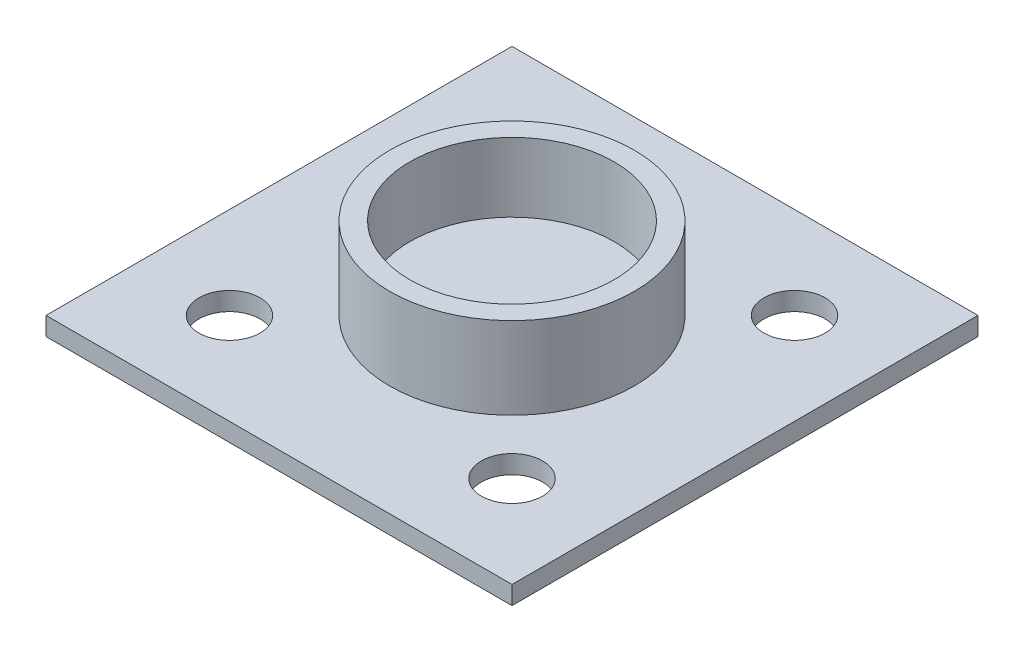
ISO-10303-21;
HEADER;
FILE_DESCRIPTION(('STEP AP214'),'2;1');
FILE_NAME('part.step','',(''),(''),'','','');
FILE_SCHEMA(('AUTOMOTIVE_DESIGN { 1 0 10303 214 1 1 1 1 }'));
ENDSEC;
DATA;
#1=APPLICATION_CONTEXT('core data for automotive mechanical design processes');
#2=APPLICATION_PROTOCOL_DEFINITION('international standard','automotive_design',2000,#1);
#3=PRODUCT_CONTEXT('',#1,'mechanical');
#4=PRODUCT('Part','Part','',(#3));
#5=PRODUCT_RELATED_PRODUCT_CATEGORY('part','',(#4));
#6=PRODUCT_DEFINITION_FORMATION('','',#4);
#7=PRODUCT_DEFINITION_CONTEXT('part definition',#1,'design');
#8=PRODUCT_DEFINITION('design','',#6,#7);
#9=PRODUCT_DEFINITION_SHAPE('','',#8);
#10=(LENGTH_UNIT() NAMED_UNIT(*) SI_UNIT(.MILLI.,.METRE.));
#11=(NAMED_UNIT(*) PLANE_ANGLE_UNIT() SI_UNIT($,.RADIAN.));
#12=(NAMED_UNIT(*) SI_UNIT($,.STERADIAN.) SOLID_ANGLE_UNIT());
#13=UNCERTAINTY_MEASURE_WITH_UNIT(LENGTH_MEASURE(1.E-05),#10,'distance_accuracy_value','');
#14=(GEOMETRIC_REPRESENTATION_CONTEXT(3) GLOBAL_UNCERTAINTY_ASSIGNED_CONTEXT((#13)) GLOBAL_UNIT_ASSIGNED_CONTEXT((#10,
#11,#12)) REPRESENTATION_CONTEXT('',''));
#15=CARTESIAN_POINT('',(0.,0.,0.));
#16=DIRECTION('',(0.,0.,1.));
#17=DIRECTION('',(1.,0.,0.));
#18=AXIS2_PLACEMENT_3D('',#15,#16,#17);
#19=CARTESIAN_POINT('',(0.,-8.2,0.));
#20=DIRECTION('',(0.,1.,0.));
#21=DIRECTION('',(0.,0.,1.));
#22=AXIS2_PLACEMENT_3D('',#19,#20,#21);
#23=CYLINDRICAL_SURFACE('',#22,10.);
#24=CARTESIAN_POINT('',(0.,0.,0.));
#25=DIRECTION('',(0.,1.,0.));
#26=DIRECTION('',(0.,0.,1.));
#27=AXIS2_PLACEMENT_3D('',#24,#25,#26);
#28=CIRCLE('',#27,10.);
#29=CARTESIAN_POINT('',(0.,0.,10.));
#30=VERTEX_POINT('',#29);
#31=EDGE_CURVE('E11',#30,#30,#28,.T.);
#32=ORIENTED_EDGE('',*,*,#31,.F.);
#33=EDGE_LOOP('',(#32));
#34=FACE_BOUND('',#33,.T.);
#35=CARTESIAN_POINT('',(0.,-6.7,0.));
#36=DIRECTION('',(0.,-1.,0.));
#37=DIRECTION('',(0.,0.,-1.));
#38=AXIS2_PLACEMENT_3D('',#35,#36,#37);
#39=CIRCLE('',#38,10.);
#40=CARTESIAN_POINT('',(0.,-6.7,-10.));
#41=VERTEX_POINT('',#40);
#42=EDGE_CURVE('E111',#41,#41,#39,.F.);
#43=ORIENTED_EDGE('',*,*,#42,.T.);
#44=EDGE_LOOP('',(#43));
#45=FACE_BOUND('',#44,.T.);
#46=ADVANCED_FACE('F32',(#34,#45),#23,.T.);
#47=CARTESIAN_POINT('',(0.,0.,0.));
#48=DIRECTION('',(0.,1.,0.));
#49=DIRECTION('',(0.,0.,1.));
#50=AXIS2_PLACEMENT_3D('',#47,#48,#49);
#51=PLANE('',#50);
#52=CARTESIAN_POINT('',(0.,0.,0.));
#53=DIRECTION('',(0.,1.,0.));
#54=DIRECTION('',(0.,0.,1.));
#55=AXIS2_PLACEMENT_3D('',#52,#53,#54);
#56=CIRCLE('',#55,8.354);
#57=CARTESIAN_POINT('',(0.,0.,8.354));
#58=VERTEX_POINT('',#57);
#59=EDGE_CURVE('E116',#58,#58,#56,.T.);
#60=ORIENTED_EDGE('',*,*,#59,.F.);
#61=EDGE_LOOP('',(#60));
#62=FACE_BOUND('',#61,.T.);
#63=ORIENTED_EDGE('',*,*,#31,.T.);
#64=EDGE_LOOP('',(#63));
#65=FACE_BOUND('',#64,.T.);
#66=ADVANCED_FACE('F150',(#62,#65),#51,.T.);
#67=CARTESIAN_POINT('',(0.,-5.65,0.));
#68=DIRECTION('',(0.,1.,0.));
#69=DIRECTION('',(0.,0.,1.));
#70=AXIS2_PLACEMENT_3D('',#67,#68,#69);
#71=CYLINDRICAL_SURFACE('',#70,8.354);
#72=CARTESIAN_POINT('',(0.,-5.65,0.));
#73=DIRECTION('',(0.,1.,0.));
#74=DIRECTION('',(0.,0.,1.));
#75=AXIS2_PLACEMENT_3D('',#72,#73,#74);
#76=CIRCLE('',#75,8.354);
#77=CARTESIAN_POINT('',(0.,-5.65,8.354));
#78=VERTEX_POINT('',#77);
#79=EDGE_CURVE('E41',#78,#78,#76,.T.);
#80=ORIENTED_EDGE('',*,*,#79,.F.);
#81=EDGE_LOOP('',(#80));
#82=FACE_BOUND('',#81,.T.);
#83=ORIENTED_EDGE('',*,*,#59,.T.);
#84=EDGE_LOOP('',(#83));
#85=FACE_BOUND('',#84,.T.);
#86=ADVANCED_FACE('F155',(#82,#85),#71,.F.);
#87=CARTESIAN_POINT('',(0.,-5.65,0.));
#88=DIRECTION('',(0.,1.,0.));
#89=DIRECTION('',(0.,0.,1.));
#90=AXIS2_PLACEMENT_3D('',#87,#88,#89);
#91=PLANE('',#90);
#92=ORIENTED_EDGE('',*,*,#79,.T.);
#93=EDGE_LOOP('',(#92));
#94=FACE_BOUND('',#93,.T.);
#95=ADVANCED_FACE('F182',(#94),#91,.T.);
#96=CARTESIAN_POINT('',(19.05,-6.7,19.05));
#97=DIRECTION('',(1.,0.,0.));
#98=DIRECTION('',(0.,0.,-1.));
#99=AXIS2_PLACEMENT_3D('',#96,#97,#98);
#100=PLANE('',#99);
#101=DIRECTION('',(0.,0.,1.));
#102=VECTOR('',#101,1.);
#103=CARTESIAN_POINT('',(19.05,-8.2,19.05));
#104=LINE('',#103,#102);
#105=CARTESIAN_POINT('',(19.05,-8.2,-19.05));
#106=VERTEX_POINT('',#105);
#107=CARTESIAN_POINT('',(19.05,-8.2,19.05));
#108=VERTEX_POINT('',#107);
#109=EDGE_CURVE('E102',#106,#108,#104,.T.);
#110=ORIENTED_EDGE('',*,*,#109,.F.);
#111=DIRECTION('',(0.,-1.,0.));
#112=VECTOR('',#111,1.);
#113=CARTESIAN_POINT('',(19.05,-6.7,-19.05));
#114=LINE('',#113,#112);
#115=CARTESIAN_POINT('',(19.05,-6.7,-19.05));
#116=VERTEX_POINT('',#115);
#117=EDGE_CURVE('E50',#116,#106,#114,.T.);
#118=ORIENTED_EDGE('',*,*,#117,.F.);
#119=DIRECTION('',(0.,0.,1.));
#120=VECTOR('',#119,1.);
#121=CARTESIAN_POINT('',(19.05,-6.7,19.05));
#122=LINE('',#121,#120);
#123=CARTESIAN_POINT('',(19.05,-6.7,19.05));
#124=VERTEX_POINT('',#123);
#125=EDGE_CURVE('E95',#116,#124,#122,.T.);
#126=ORIENTED_EDGE('',*,*,#125,.T.);
#127=DIRECTION('',(0.,-1.,0.));
#128=VECTOR('',#127,1.);
#129=CARTESIAN_POINT('',(19.05,-6.7,19.05));
#130=LINE('',#129,#128);
#131=EDGE_CURVE('E78',#124,#108,#130,.T.);
#132=ORIENTED_EDGE('',*,*,#131,.T.);
#133=EDGE_LOOP('',(#110,#118,#126,#132));
#134=FACE_BOUND('',#133,.T.);
#135=ADVANCED_FACE('F177',(#134),#100,.T.);
#136=CARTESIAN_POINT('',(-19.05,-6.7,-19.05));
#137=DIRECTION('',(0.,0.,-1.));
#138=DIRECTION('',(-1.,0.,0.));
#139=AXIS2_PLACEMENT_3D('',#136,#137,#138);
#140=PLANE('',#139);
#141=DIRECTION('',(1.,0.,0.));
#142=VECTOR('',#141,1.);
#143=CARTESIAN_POINT('',(-19.05,-8.2,-19.05));
#144=LINE('',#143,#142);
#145=CARTESIAN_POINT('',(-19.05,-8.2,-19.05));
#146=VERTEX_POINT('',#145);
#147=EDGE_CURVE('E97',#146,#106,#144,.T.);
#148=ORIENTED_EDGE('',*,*,#147,.F.);
#149=DIRECTION('',(0.,-1.,0.));
#150=VECTOR('',#149,1.);
#151=CARTESIAN_POINT('',(-19.05,-6.7,-19.05));
#152=LINE('',#151,#150);
#153=CARTESIAN_POINT('',(-19.05,-6.7,-19.05));
#154=VERTEX_POINT('',#153);
#155=EDGE_CURVE('E67',#154,#146,#152,.T.);
#156=ORIENTED_EDGE('',*,*,#155,.F.);
#157=DIRECTION('',(1.,0.,0.));
#158=VECTOR('',#157,1.);
#159=CARTESIAN_POINT('',(-19.05,-6.7,-19.05));
#160=LINE('',#159,#158);
#161=EDGE_CURVE('E92',#154,#116,#160,.T.);
#162=ORIENTED_EDGE('',*,*,#161,.T.);
#163=ORIENTED_EDGE('',*,*,#117,.T.);
#164=EDGE_LOOP('',(#148,#156,#162,#163));
#165=FACE_BOUND('',#164,.T.);
#166=ADVANCED_FACE('F174',(#165),#140,.T.);
#167=CARTESIAN_POINT('',(-19.05,-6.7,19.05));
#168=DIRECTION('',(-1.,0.,0.));
#169=DIRECTION('',(0.,0.,1.));
#170=AXIS2_PLACEMENT_3D('',#167,#168,#169);
#171=PLANE('',#170);
#172=DIRECTION('',(0.,0.,-1.));
#173=VECTOR('',#172,1.);
#174=CARTESIAN_POINT('',(-19.05,-8.2,19.05));
#175=LINE('',#174,#173);
#176=CARTESIAN_POINT('',(-19.05,-8.2,19.05));
#177=VERTEX_POINT('',#176);
#178=EDGE_CURVE('E86',#177,#146,#175,.T.);
#179=ORIENTED_EDGE('',*,*,#178,.F.);
#180=DIRECTION('',(0.,-1.,0.));
#181=VECTOR('',#180,1.);
#182=CARTESIAN_POINT('',(-19.05,-6.7,19.05));
#183=LINE('',#182,#181);
#184=CARTESIAN_POINT('',(-19.05,-6.7,19.05));
#185=VERTEX_POINT('',#184);
#186=EDGE_CURVE('E81',#185,#177,#183,.T.);
#187=ORIENTED_EDGE('',*,*,#186,.F.);
#188=DIRECTION('',(0.,0.,-1.));
#189=VECTOR('',#188,1.);
#190=CARTESIAN_POINT('',(-19.05,-6.7,19.05));
#191=LINE('',#190,#189);
#192=EDGE_CURVE('E84',#185,#154,#191,.T.);
#193=ORIENTED_EDGE('',*,*,#192,.T.);
#194=ORIENTED_EDGE('',*,*,#155,.T.);
#195=EDGE_LOOP('',(#179,#187,#193,#194));
#196=FACE_BOUND('',#195,.T.);
#197=ADVANCED_FACE('F83',(#196),#171,.T.);
#198=CARTESIAN_POINT('',(-19.05,-6.7,19.05));
#199=DIRECTION('',(0.,0.,1.));
#200=DIRECTION('',(1.,0.,0.));
#201=AXIS2_PLACEMENT_3D('',#198,#199,#200);
#202=PLANE('',#201);
#203=DIRECTION('',(-1.,0.,0.));
#204=VECTOR('',#203,1.);
#205=CARTESIAN_POINT('',(-19.05,-8.2,19.05));
#206=LINE('',#205,#204);
#207=EDGE_CURVE('E105',#108,#177,#206,.T.);
#208=ORIENTED_EDGE('',*,*,#207,.F.);
#209=ORIENTED_EDGE('',*,*,#131,.F.);
#210=DIRECTION('',(-1.,0.,0.));
#211=VECTOR('',#210,1.);
#212=CARTESIAN_POINT('',(-19.05,-6.7,19.05));
#213=LINE('',#212,#211);
#214=EDGE_CURVE('E91',#124,#185,#213,.T.);
#215=ORIENTED_EDGE('',*,*,#214,.T.);
#216=ORIENTED_EDGE('',*,*,#186,.T.);
#217=EDGE_LOOP('',(#208,#209,#215,#216));
#218=FACE_BOUND('',#217,.T.);
#219=ADVANCED_FACE('F94',(#218),#202,.T.);
#220=CARTESIAN_POINT('',(0.,-6.7,0.));
#221=DIRECTION('',(0.,-1.,0.));
#222=DIRECTION('',(0.,0.,-1.));
#223=AXIS2_PLACEMENT_3D('',#220,#221,#222);
#224=PLANE('',#223);
#225=CARTESIAN_POINT('',(-11.5499999999993,-6.7,11.55));
#226=DIRECTION('',(0.,1.,0.));
#227=DIRECTION('',(0.,0.,1.));
#228=AXIS2_PLACEMENT_3D('',#225,#226,#227);
#229=CIRCLE('',#228,2.50000000000035);
#230=CARTESIAN_POINT('',(-11.5499999999993,-6.7,14.0500000000004));
#231=VERTEX_POINT('',#230);
#232=EDGE_CURVE('E273',#231,#231,#229,.T.);
#233=ORIENTED_EDGE('',*,*,#232,.F.);
#234=EDGE_LOOP('',(#233));
#235=FACE_BOUND('',#234,.T.);
#236=CARTESIAN_POINT('',(11.5500000000007,-6.7,11.5499999999994));
#237=DIRECTION('',(0.,1.,0.));
#238=DIRECTION('',(0.,0.,1.));
#239=AXIS2_PLACEMENT_3D('',#236,#237,#238);
#240=CIRCLE('',#239,2.50000000000092);
#241=CARTESIAN_POINT('',(11.5500000000007,-6.7,14.0500000000003));
#242=VERTEX_POINT('',#241);
#243=EDGE_CURVE('E269',#242,#242,#240,.T.);
#244=ORIENTED_EDGE('',*,*,#243,.F.);
#245=EDGE_LOOP('',(#244));
#246=FACE_BOUND('',#245,.T.);
#247=CARTESIAN_POINT('',(11.55,-6.7,-11.5500000000007));
#248=DIRECTION('',(0.,1.,0.));
#249=DIRECTION('',(0.,0.,1.));
#250=AXIS2_PLACEMENT_3D('',#247,#248,#249);
#251=CIRCLE('',#250,2.50000000000068);
#252=CARTESIAN_POINT('',(11.55,-6.7,-9.04999999999998));
#253=VERTEX_POINT('',#252);
#254=EDGE_CURVE('E261',#253,#253,#251,.T.);
#255=ORIENTED_EDGE('',*,*,#254,.F.);
#256=EDGE_LOOP('',(#255));
#257=FACE_BOUND('',#256,.T.);
#258=CARTESIAN_POINT('',(-11.55,-6.7,-11.55));
#259=DIRECTION('',(0.,1.,0.));
#260=DIRECTION('',(0.,0.,1.));
#261=AXIS2_PLACEMENT_3D('',#258,#259,#260);
#262=CIRCLE('',#261,2.5);
#263=CARTESIAN_POINT('',(-11.55,-6.7,-9.05));
#264=VERTEX_POINT('',#263);
#265=EDGE_CURVE('E125',#264,#264,#262,.T.);
#266=ORIENTED_EDGE('',*,*,#265,.F.);
#267=EDGE_LOOP('',(#266));
#268=FACE_BOUND('',#267,.T.);
#269=ORIENTED_EDGE('',*,*,#42,.F.);
#270=EDGE_LOOP('',(#269));
#271=FACE_BOUND('',#270,.T.);
#272=ORIENTED_EDGE('',*,*,#125,.F.);
#273=ORIENTED_EDGE('',*,*,#161,.F.);
#274=ORIENTED_EDGE('',*,*,#192,.F.);
#275=ORIENTED_EDGE('',*,*,#214,.F.);
#276=EDGE_LOOP('',(#272,#273,#274,#275));
#277=FACE_BOUND('',#276,.T.);
#278=ADVANCED_FACE('F90',(#235,#246,#257,#268,#271,#277),#224,.F.);
#279=CARTESIAN_POINT('',(0.,-8.2,0.));
#280=DIRECTION('',(0.,1.,0.));
#281=DIRECTION('',(0.,0.,1.));
#282=AXIS2_PLACEMENT_3D('',#279,#280,#281);
#283=PLANE('',#282);
#284=CARTESIAN_POINT('',(-11.5499999999993,-8.2,11.55));
#285=DIRECTION('',(0.,1.,0.));
#286=DIRECTION('',(0.,0.,1.));
#287=AXIS2_PLACEMENT_3D('',#284,#285,#286);
#288=CIRCLE('',#287,2.50000000000035);
#289=CARTESIAN_POINT('',(-11.5499999999993,-8.2,14.0500000000004));
#290=VERTEX_POINT('',#289);
#291=EDGE_CURVE('E35',#290,#290,#288,.T.);
#292=ORIENTED_EDGE('',*,*,#291,.T.);
#293=EDGE_LOOP('',(#292));
#294=FACE_BOUND('',#293,.T.);
#295=CARTESIAN_POINT('',(11.5500000000007,-8.2,11.5499999999994));
#296=DIRECTION('',(0.,1.,0.));
#297=DIRECTION('',(0.,0.,1.));
#298=AXIS2_PLACEMENT_3D('',#295,#296,#297);
#299=CIRCLE('',#298,2.50000000000092);
#300=CARTESIAN_POINT('',(11.5500000000007,-8.2,14.0500000000003));
#301=VERTEX_POINT('',#300);
#302=EDGE_CURVE('E127',#301,#301,#299,.T.);
#303=ORIENTED_EDGE('',*,*,#302,.T.);
#304=EDGE_LOOP('',(#303));
#305=FACE_BOUND('',#304,.T.);
#306=CARTESIAN_POINT('',(11.55,-8.2,-11.5500000000007));
#307=DIRECTION('',(0.,1.,0.));
#308=DIRECTION('',(0.,0.,1.));
#309=AXIS2_PLACEMENT_3D('',#306,#307,#308);
#310=CIRCLE('',#309,2.50000000000068);
#311=CARTESIAN_POINT('',(11.55,-8.2,-9.04999999999998));
#312=VERTEX_POINT('',#311);
#313=EDGE_CURVE('E124',#312,#312,#310,.T.);
#314=ORIENTED_EDGE('',*,*,#313,.T.);
#315=EDGE_LOOP('',(#314));
#316=FACE_BOUND('',#315,.T.);
#317=CARTESIAN_POINT('',(-11.55,-8.2,-11.55));
#318=DIRECTION('',(0.,1.,0.));
#319=DIRECTION('',(0.,0.,1.));
#320=AXIS2_PLACEMENT_3D('',#317,#318,#319);
#321=CIRCLE('',#320,2.5);
#322=CARTESIAN_POINT('',(-11.55,-8.2,-9.05));
#323=VERTEX_POINT('',#322);
#324=EDGE_CURVE('E121',#323,#323,#321,.T.);
#325=ORIENTED_EDGE('',*,*,#324,.T.);
#326=EDGE_LOOP('',(#325));
#327=FACE_BOUND('',#326,.T.);
#328=ORIENTED_EDGE('',*,*,#109,.T.);
#329=ORIENTED_EDGE('',*,*,#207,.T.);
#330=ORIENTED_EDGE('',*,*,#178,.T.);
#331=ORIENTED_EDGE('',*,*,#147,.T.);
#332=EDGE_LOOP('',(#328,#329,#330,#331));
#333=FACE_BOUND('',#332,.T.);
#334=ADVANCED_FACE('F134',(#294,#305,#316,#327,#333),#283,.F.);
#335=CARTESIAN_POINT('',(-11.55,-8.7,-11.55));
#336=DIRECTION('',(0.,1.,0.));
#337=DIRECTION('',(0.,0.,1.));
#338=AXIS2_PLACEMENT_3D('',#335,#336,#337);
#339=CYLINDRICAL_SURFACE('',#338,2.5);
#340=ORIENTED_EDGE('',*,*,#265,.T.);
#341=EDGE_LOOP('',(#340));
#342=FACE_BOUND('',#341,.T.);
#343=ORIENTED_EDGE('',*,*,#324,.F.);
#344=EDGE_LOOP('',(#343));
#345=FACE_BOUND('',#344,.T.);
#346=ADVANCED_FACE('F168',(#342,#345),#339,.F.);
#347=CARTESIAN_POINT('',(11.55,-8.7,-11.5500000000007));
#348=DIRECTION('',(0.,1.,0.));
#349=DIRECTION('',(0.,0.,1.));
#350=AXIS2_PLACEMENT_3D('',#347,#348,#349);
#351=CYLINDRICAL_SURFACE('',#350,2.50000000000068);
#352=ORIENTED_EDGE('',*,*,#254,.T.);
#353=EDGE_LOOP('',(#352));
#354=FACE_BOUND('',#353,.T.);
#355=ORIENTED_EDGE('',*,*,#313,.F.);
#356=EDGE_LOOP('',(#355));
#357=FACE_BOUND('',#356,.T.);
#358=ADVANCED_FACE('F144',(#354,#357),#351,.F.);
#359=CARTESIAN_POINT('',(11.5500000000007,-8.7,11.5499999999994));
#360=DIRECTION('',(0.,1.,0.));
#361=DIRECTION('',(0.,0.,1.));
#362=AXIS2_PLACEMENT_3D('',#359,#360,#361);
#363=CYLINDRICAL_SURFACE('',#362,2.50000000000092);
#364=ORIENTED_EDGE('',*,*,#243,.T.);
#365=EDGE_LOOP('',(#364));
#366=FACE_BOUND('',#365,.T.);
#367=ORIENTED_EDGE('',*,*,#302,.F.);
#368=EDGE_LOOP('',(#367));
#369=FACE_BOUND('',#368,.T.);
#370=ADVANCED_FACE('F138',(#366,#369),#363,.F.);
#371=CARTESIAN_POINT('',(-11.5499999999993,-8.7,11.55));
#372=DIRECTION('',(0.,1.,0.));
#373=DIRECTION('',(0.,0.,1.));
#374=AXIS2_PLACEMENT_3D('',#371,#372,#373);
#375=CYLINDRICAL_SURFACE('',#374,2.50000000000035);
#376=ORIENTED_EDGE('',*,*,#232,.T.);
#377=EDGE_LOOP('',(#376));
#378=FACE_BOUND('',#377,.T.);
#379=ORIENTED_EDGE('',*,*,#291,.F.);
#380=EDGE_LOOP('',(#379));
#381=FACE_BOUND('',#380,.T.);
#382=ADVANCED_FACE('F136',(#378,#381),#375,.F.);
#383=CLOSED_SHELL('',(#46,#66,#86,#95,#135,#166,#197,#219,#278,#334,#346,#358,#370,#382));
#384=MANIFOLD_SOLID_BREP('B2',#383);
#385=ADVANCED_BREP_SHAPE_REPRESENTATION('',(#18,#384),#14);
#386=SHAPE_DEFINITION_REPRESENTATION(#9,#385);
ENDSEC;
END-ISO-10303-21;
